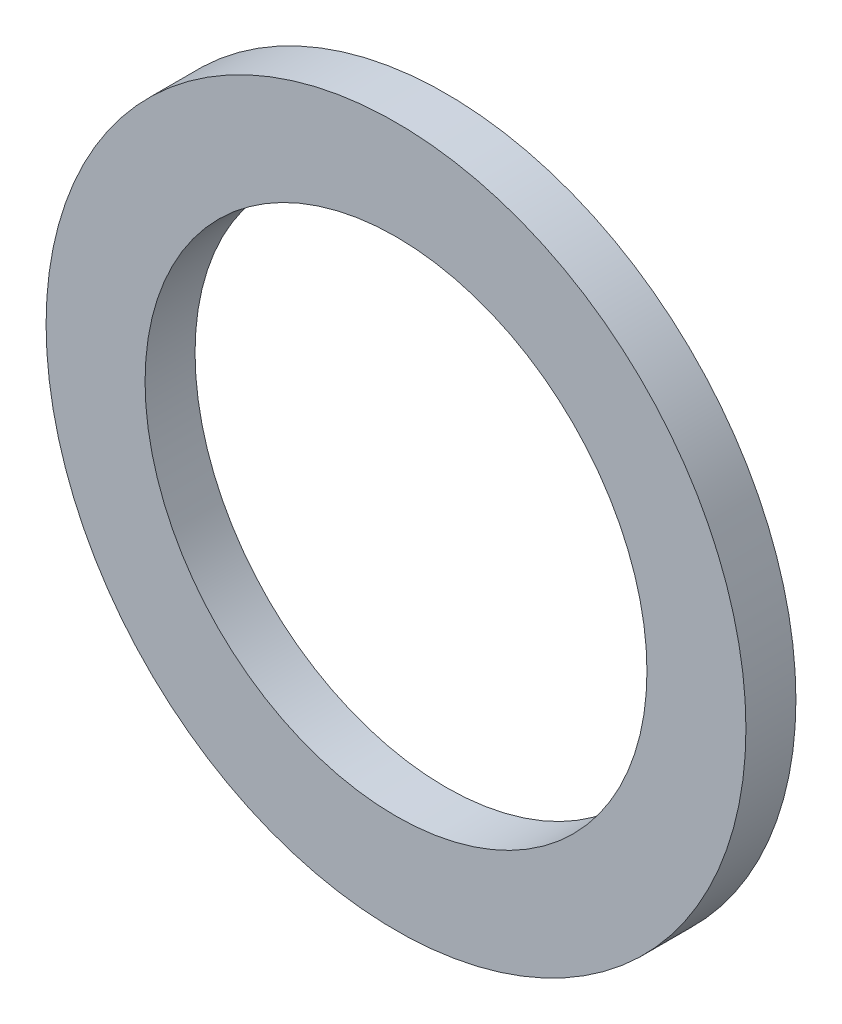
ISO-10303-21;
HEADER;
FILE_DESCRIPTION(('STEP AP214'),'2;1');
FILE_NAME('part.step','',(''),(''),'','','');
FILE_SCHEMA(('AUTOMOTIVE_DESIGN { 1 0 10303 214 1 1 1 1 }'));
ENDSEC;
DATA;
#1=APPLICATION_CONTEXT('core data for automotive mechanical design processes');
#2=APPLICATION_PROTOCOL_DEFINITION('international standard','automotive_design',2000,#1);
#3=PRODUCT_CONTEXT('',#1,'mechanical');
#4=PRODUCT('Part','Part','',(#3));
#5=PRODUCT_RELATED_PRODUCT_CATEGORY('part','',(#4));
#6=PRODUCT_DEFINITION_FORMATION('','',#4);
#7=PRODUCT_DEFINITION_CONTEXT('part definition',#1,'design');
#8=PRODUCT_DEFINITION('design','',#6,#7);
#9=PRODUCT_DEFINITION_SHAPE('','',#8);
#10=(LENGTH_UNIT() NAMED_UNIT(*) SI_UNIT(.MILLI.,.METRE.));
#11=(NAMED_UNIT(*) PLANE_ANGLE_UNIT() SI_UNIT($,.RADIAN.));
#12=(NAMED_UNIT(*) SI_UNIT($,.STERADIAN.) SOLID_ANGLE_UNIT());
#13=UNCERTAINTY_MEASURE_WITH_UNIT(LENGTH_MEASURE(1.E-05),#10,'distance_accuracy_value','');
#14=(GEOMETRIC_REPRESENTATION_CONTEXT(3) GLOBAL_UNCERTAINTY_ASSIGNED_CONTEXT((#13)) GLOBAL_UNIT_ASSIGNED_CONTEXT((#10,
#11,#12)) REPRESENTATION_CONTEXT('',''));
#15=CARTESIAN_POINT('',(0.,0.,0.));
#16=DIRECTION('',(0.,0.,1.));
#17=DIRECTION('',(1.,0.,0.));
#18=AXIS2_PLACEMENT_3D('',#15,#16,#17);
#19=CARTESIAN_POINT('',(0.,0.,3.175));
#20=DIRECTION('',(0.,0.,1.));
#21=DIRECTION('',(1.,0.,0.));
#22=AXIS2_PLACEMENT_3D('',#19,#20,#21);
#23=PLANE('',#22);
#24=CARTESIAN_POINT('',(0.,0.,3.175));
#25=DIRECTION('',(0.,0.,1.));
#26=DIRECTION('',(1.,0.,0.));
#27=AXIS2_PLACEMENT_3D('',#24,#25,#26);
#28=CIRCLE('',#27,22.225);
#29=CARTESIAN_POINT('',(22.225,0.,3.175));
#30=VERTEX_POINT('',#29);
#31=EDGE_CURVE('E10',#30,#30,#28,.T.);
#32=ORIENTED_EDGE('',*,*,#31,.T.);
#33=EDGE_LOOP('',(#32));
#34=FACE_BOUND('',#33,.T.);
#35=CARTESIAN_POINT('',(0.,0.,3.175));
#36=DIRECTION('',(0.,0.,1.));
#37=DIRECTION('',(1.,0.,0.));
#38=AXIS2_PLACEMENT_3D('',#35,#36,#37);
#39=CIRCLE('',#38,15.9385);
#40=CARTESIAN_POINT('',(15.9385,0.,3.175));
#41=VERTEX_POINT('',#40);
#42=EDGE_CURVE('E43',#41,#41,#39,.T.);
#43=ORIENTED_EDGE('',*,*,#42,.F.);
#44=EDGE_LOOP('',(#43));
#45=FACE_BOUND('',#44,.T.);
#46=ADVANCED_FACE('F32',(#34,#45),#23,.T.);
#47=CARTESIAN_POINT('',(0.,0.,0.));
#48=DIRECTION('',(0.,0.,1.));
#49=DIRECTION('',(1.,0.,0.));
#50=AXIS2_PLACEMENT_3D('',#47,#48,#49);
#51=PLANE('',#50);
#52=CARTESIAN_POINT('',(0.,0.,0.));
#53=DIRECTION('',(0.,0.,1.));
#54=DIRECTION('',(1.,0.,0.));
#55=AXIS2_PLACEMENT_3D('',#52,#53,#54);
#56=CIRCLE('',#55,22.225);
#57=CARTESIAN_POINT('',(22.225,0.,0.));
#58=VERTEX_POINT('',#57);
#59=EDGE_CURVE('E36',#58,#58,#56,.T.);
#60=ORIENTED_EDGE('',*,*,#59,.F.);
#61=EDGE_LOOP('',(#60));
#62=FACE_BOUND('',#61,.T.);
#63=CARTESIAN_POINT('',(0.,0.,0.));
#64=DIRECTION('',(0.,0.,1.));
#65=DIRECTION('',(1.,0.,0.));
#66=AXIS2_PLACEMENT_3D('',#63,#64,#65);
#67=CIRCLE('',#66,15.9385);
#68=CARTESIAN_POINT('',(15.9385,0.,0.));
#69=VERTEX_POINT('',#68);
#70=EDGE_CURVE('E45',#69,#69,#67,.T.);
#71=ORIENTED_EDGE('',*,*,#70,.T.);
#72=EDGE_LOOP('',(#71));
#73=FACE_BOUND('',#72,.T.);
#74=ADVANCED_FACE('F55',(#62,#73),#51,.F.);
#75=CARTESIAN_POINT('',(0.,0.,3.175));
#76=DIRECTION('',(0.,0.,-1.));
#77=DIRECTION('',(-1.,0.,0.));
#78=AXIS2_PLACEMENT_3D('',#75,#76,#77);
#79=CYLINDRICAL_SURFACE('',#78,22.225);
#80=ORIENTED_EDGE('',*,*,#31,.F.);
#81=EDGE_LOOP('',(#80));
#82=FACE_BOUND('',#81,.T.);
#83=ORIENTED_EDGE('',*,*,#59,.T.);
#84=EDGE_LOOP('',(#83));
#85=FACE_BOUND('',#84,.T.);
#86=ADVANCED_FACE('F34',(#82,#85),#79,.T.);
#87=CARTESIAN_POINT('',(0.,0.,3.175));
#88=DIRECTION('',(0.,0.,-1.));
#89=DIRECTION('',(-1.,0.,0.));
#90=AXIS2_PLACEMENT_3D('',#87,#88,#89);
#91=CYLINDRICAL_SURFACE('',#90,15.9385);
#92=ORIENTED_EDGE('',*,*,#42,.T.);
#93=EDGE_LOOP('',(#92));
#94=FACE_BOUND('',#93,.T.);
#95=ORIENTED_EDGE('',*,*,#70,.F.);
#96=EDGE_LOOP('',(#95));
#97=FACE_BOUND('',#96,.T.);
#98=ADVANCED_FACE('F51',(#94,#97),#91,.F.);
#99=CLOSED_SHELL('',(#46,#74,#86,#98));
#100=MANIFOLD_SOLID_BREP('B2',#99);
#101=ADVANCED_BREP_SHAPE_REPRESENTATION('',(#18,#100),#14);
#102=SHAPE_DEFINITION_REPRESENTATION(#9,#101);
ENDSEC;
END-ISO-10303-21;
